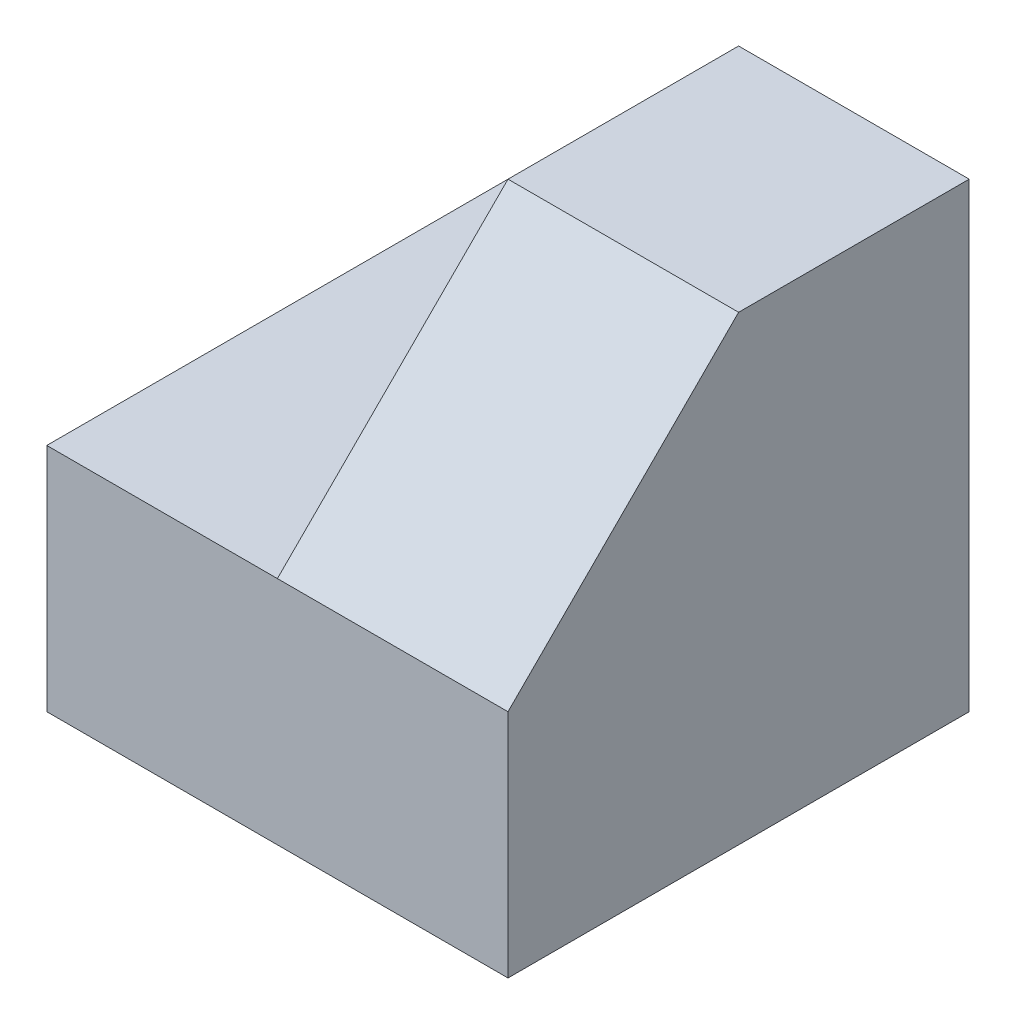
ISO-10303-21;
HEADER;
FILE_DESCRIPTION(('STEP AP214'),'2;1');
FILE_NAME('part.step','',(''),(''),'','','');
FILE_SCHEMA(('AUTOMOTIVE_DESIGN { 1 0 10303 214 1 1 1 1 }'));
ENDSEC;
DATA;
#1=APPLICATION_CONTEXT('core data for automotive mechanical design processes');
#2=APPLICATION_PROTOCOL_DEFINITION('international standard','automotive_design',2000,#1);
#3=PRODUCT_CONTEXT('',#1,'mechanical');
#4=PRODUCT('Part','Part','',(#3));
#5=PRODUCT_RELATED_PRODUCT_CATEGORY('part','',(#4));
#6=PRODUCT_DEFINITION_FORMATION('','',#4);
#7=PRODUCT_DEFINITION_CONTEXT('part definition',#1,'design');
#8=PRODUCT_DEFINITION('design','',#6,#7);
#9=PRODUCT_DEFINITION_SHAPE('','',#8);
#10=(LENGTH_UNIT() NAMED_UNIT(*) SI_UNIT(.MILLI.,.METRE.));
#11=(NAMED_UNIT(*) PLANE_ANGLE_UNIT() SI_UNIT($,.RADIAN.));
#12=(NAMED_UNIT(*) SI_UNIT($,.STERADIAN.) SOLID_ANGLE_UNIT());
#13=UNCERTAINTY_MEASURE_WITH_UNIT(LENGTH_MEASURE(1.E-05),#10,'distance_accuracy_value','');
#14=(GEOMETRIC_REPRESENTATION_CONTEXT(3) GLOBAL_UNCERTAINTY_ASSIGNED_CONTEXT((#13)) GLOBAL_UNIT_ASSIGNED_CONTEXT((#10,
#11,#12)) REPRESENTATION_CONTEXT('',''));
#15=CARTESIAN_POINT('',(0.,0.,0.));
#16=DIRECTION('',(0.,0.,1.));
#17=DIRECTION('',(1.,0.,0.));
#18=AXIS2_PLACEMENT_3D('',#15,#16,#17);
#19=CARTESIAN_POINT('',(0.,0.,40.));
#20=DIRECTION('',(1.,0.,0.));
#21=DIRECTION('',(0.,0.,-1.));
#22=AXIS2_PLACEMENT_3D('',#19,#20,#21);
#23=PLANE('',#22);
#24=DIRECTION('',(0.,-1.,0.));
#25=VECTOR('',#24,1.);
#26=CARTESIAN_POINT('',(0.,0.,40.));
#27=LINE('',#26,#25);
#28=CARTESIAN_POINT('',(0.,20.,40.));
#29=VERTEX_POINT('',#28);
#30=CARTESIAN_POINT('',(0.,0.,40.));
#31=VERTEX_POINT('',#30);
#32=EDGE_CURVE('E121',#29,#31,#27,.T.);
#33=ORIENTED_EDGE('',*,*,#32,.F.);
#34=DIRECTION('',(0.,0.,1.));
#35=VECTOR('',#34,1.);
#36=CARTESIAN_POINT('',(0.,20.,0.));
#37=LINE('',#36,#35);
#38=CARTESIAN_POINT('',(0.,20.,0.));
#39=VERTEX_POINT('',#38);
#40=EDGE_CURVE('E108',#39,#29,#37,.T.);
#41=ORIENTED_EDGE('',*,*,#40,.F.);
#42=DIRECTION('',(0.,-1.,0.));
#43=VECTOR('',#42,1.);
#44=CARTESIAN_POINT('',(0.,0.,0.));
#45=LINE('',#44,#43);
#46=CARTESIAN_POINT('',(0.,0.,0.));
#47=VERTEX_POINT('',#46);
#48=EDGE_CURVE('E118',#39,#47,#45,.T.);
#49=ORIENTED_EDGE('',*,*,#48,.T.);
#50=DIRECTION('',(0.,0.,-1.));
#51=VECTOR('',#50,1.);
#52=CARTESIAN_POINT('',(0.,0.,40.));
#53=LINE('',#52,#51);
#54=EDGE_CURVE('E11',#31,#47,#53,.T.);
#55=ORIENTED_EDGE('',*,*,#54,.F.);
#56=EDGE_LOOP('',(#33,#41,#49,#55));
#57=FACE_BOUND('',#56,.T.);
#58=ADVANCED_FACE('F32',(#57),#23,.F.);
#59=CARTESIAN_POINT('',(0.,0.,40.));
#60=DIRECTION('',(0.,1.,0.));
#61=DIRECTION('',(0.,0.,1.));
#62=AXIS2_PLACEMENT_3D('',#59,#60,#61);
#63=PLANE('',#62);
#64=DIRECTION('',(1.,0.,0.));
#65=VECTOR('',#64,1.);
#66=CARTESIAN_POINT('',(0.,0.,0.));
#67=LINE('',#66,#65);
#68=CARTESIAN_POINT('',(40.,0.,0.));
#69=VERTEX_POINT('',#68);
#70=EDGE_CURVE('E129',#47,#69,#67,.T.);
#71=ORIENTED_EDGE('',*,*,#70,.T.);
#72=DIRECTION('',(0.,0.,-1.));
#73=VECTOR('',#72,1.);
#74=CARTESIAN_POINT('',(40.,0.,40.));
#75=LINE('',#74,#73);
#76=CARTESIAN_POINT('',(40.,0.,40.));
#77=VERTEX_POINT('',#76);
#78=EDGE_CURVE('E39',#77,#69,#75,.T.);
#79=ORIENTED_EDGE('',*,*,#78,.F.);
#80=DIRECTION('',(1.,0.,0.));
#81=VECTOR('',#80,1.);
#82=CARTESIAN_POINT('',(0.,0.,40.));
#83=LINE('',#82,#81);
#84=EDGE_CURVE('E123',#31,#77,#83,.T.);
#85=ORIENTED_EDGE('',*,*,#84,.F.);
#86=ORIENTED_EDGE('',*,*,#54,.T.);
#87=EDGE_LOOP('',(#71,#79,#85,#86));
#88=FACE_BOUND('',#87,.T.);
#89=ADVANCED_FACE('F159',(#88),#63,.F.);
#90=CARTESIAN_POINT('',(40.,0.,40.));
#91=DIRECTION('',(-1.,0.,0.));
#92=DIRECTION('',(0.,0.,1.));
#93=AXIS2_PLACEMENT_3D('',#90,#91,#92);
#94=PLANE('',#93);
#95=DIRECTION('',(0.,0.,-1.));
#96=VECTOR('',#95,1.);
#97=CARTESIAN_POINT('',(40.,40.,40.));
#98=LINE('',#97,#96);
#99=CARTESIAN_POINT('',(40.,40.,20.));
#100=VERTEX_POINT('',#99);
#101=CARTESIAN_POINT('',(40.,40.,0.));
#102=VERTEX_POINT('',#101);
#103=EDGE_CURVE('E127',#100,#102,#98,.T.);
#104=ORIENTED_EDGE('',*,*,#103,.F.);
#105=DIRECTION('',(0.,-0.707106781186548,0.707106781186547));
#106=VECTOR('',#105,1.);
#107=CARTESIAN_POINT('',(40.,9.99999999999999,50.));
#108=LINE('',#107,#106);
#109=CARTESIAN_POINT('',(40.,20.,40.));
#110=VERTEX_POINT('',#109);
#111=EDGE_CURVE('E101',#100,#110,#108,.T.);
#112=ORIENTED_EDGE('',*,*,#111,.T.);
#113=DIRECTION('',(0.,1.,0.));
#114=VECTOR('',#113,1.);
#115=CARTESIAN_POINT('',(40.,0.,40.));
#116=LINE('',#115,#114);
#117=EDGE_CURVE('E100',#77,#110,#116,.T.);
#118=ORIENTED_EDGE('',*,*,#117,.F.);
#119=ORIENTED_EDGE('',*,*,#78,.T.);
#120=DIRECTION('',(0.,1.,0.));
#121=VECTOR('',#120,1.);
#122=CARTESIAN_POINT('',(40.,0.,0.));
#123=LINE('',#122,#121);
#124=EDGE_CURVE('E131',#69,#102,#123,.T.);
#125=ORIENTED_EDGE('',*,*,#124,.T.);
#126=EDGE_LOOP('',(#104,#112,#118,#119,#125));
#127=FACE_BOUND('',#126,.T.);
#128=ADVANCED_FACE('F141',(#127),#94,.F.);
#129=CARTESIAN_POINT('',(0.,40.,40.));
#130=DIRECTION('',(0.,-1.,0.));
#131=DIRECTION('',(0.,0.,-1.));
#132=AXIS2_PLACEMENT_3D('',#129,#130,#131);
#133=PLANE('',#132);
#134=DIRECTION('',(0.,0.,1.));
#135=VECTOR('',#134,1.);
#136=CARTESIAN_POINT('',(20.,40.,0.));
#137=LINE('',#136,#135);
#138=CARTESIAN_POINT('',(20.,40.,0.));
#139=VERTEX_POINT('',#138);
#140=CARTESIAN_POINT('',(20.,40.,20.));
#141=VERTEX_POINT('',#140);
#142=EDGE_CURVE('E107',#139,#141,#137,.T.);
#143=ORIENTED_EDGE('',*,*,#142,.T.);
#144=DIRECTION('',(-1.,0.,0.));
#145=VECTOR('',#144,1.);
#146=CARTESIAN_POINT('',(60.,40.,20.));
#147=LINE('',#146,#145);
#148=EDGE_CURVE('E46',#100,#141,#147,.T.);
#149=ORIENTED_EDGE('',*,*,#148,.F.);
#150=ORIENTED_EDGE('',*,*,#103,.T.);
#151=DIRECTION('',(-1.,0.,0.));
#152=VECTOR('',#151,1.);
#153=CARTESIAN_POINT('',(0.,40.,0.));
#154=LINE('',#153,#152);
#155=EDGE_CURVE('E124',#102,#139,#154,.T.);
#156=ORIENTED_EDGE('',*,*,#155,.T.);
#157=EDGE_LOOP('',(#143,#149,#150,#156));
#158=FACE_BOUND('',#157,.T.);
#159=ADVANCED_FACE('F150',(#158),#133,.F.);
#160=CARTESIAN_POINT('',(0.,0.,40.));
#161=DIRECTION('',(0.,0.,-1.));
#162=DIRECTION('',(-1.,0.,0.));
#163=AXIS2_PLACEMENT_3D('',#160,#161,#162);
#164=PLANE('',#163);
#165=ORIENTED_EDGE('',*,*,#117,.T.);
#166=DIRECTION('',(-1.,0.,0.));
#167=VECTOR('',#166,1.);
#168=CARTESIAN_POINT('',(60.,20.,40.));
#169=LINE('',#168,#167);
#170=CARTESIAN_POINT('',(20.,20.,40.));
#171=VERTEX_POINT('',#170);
#172=EDGE_CURVE('E88',#110,#171,#169,.T.);
#173=ORIENTED_EDGE('',*,*,#172,.T.);
#174=DIRECTION('',(1.,0.,0.));
#175=VECTOR('',#174,1.);
#176=CARTESIAN_POINT('',(0.,20.,40.));
#177=LINE('',#176,#175);
#178=EDGE_CURVE('E97',#29,#171,#177,.T.);
#179=ORIENTED_EDGE('',*,*,#178,.F.);
#180=ORIENTED_EDGE('',*,*,#32,.T.);
#181=ORIENTED_EDGE('',*,*,#84,.T.);
#182=EDGE_LOOP('',(#165,#173,#179,#180,#181));
#183=FACE_BOUND('',#182,.T.);
#184=ADVANCED_FACE('F95',(#183),#164,.F.);
#185=CARTESIAN_POINT('',(0.,0.,0.));
#186=DIRECTION('',(0.,0.,-1.));
#187=DIRECTION('',(-1.,0.,0.));
#188=AXIS2_PLACEMENT_3D('',#185,#186,#187);
#189=PLANE('',#188);
#190=DIRECTION('',(0.,1.,0.));
#191=VECTOR('',#190,1.);
#192=CARTESIAN_POINT('',(20.,40.,0.));
#193=LINE('',#192,#191);
#194=CARTESIAN_POINT('',(20.,20.,0.));
#195=VERTEX_POINT('',#194);
#196=EDGE_CURVE('E54',#195,#139,#193,.T.);
#197=ORIENTED_EDGE('',*,*,#196,.T.);
#198=ORIENTED_EDGE('',*,*,#155,.F.);
#199=ORIENTED_EDGE('',*,*,#124,.F.);
#200=ORIENTED_EDGE('',*,*,#70,.F.);
#201=ORIENTED_EDGE('',*,*,#48,.F.);
#202=DIRECTION('',(1.,0.,0.));
#203=VECTOR('',#202,1.);
#204=CARTESIAN_POINT('',(0.,20.,0.));
#205=LINE('',#204,#203);
#206=EDGE_CURVE('E112',#39,#195,#205,.T.);
#207=ORIENTED_EDGE('',*,*,#206,.T.);
#208=EDGE_LOOP('',(#197,#198,#199,#200,#201,#207));
#209=FACE_BOUND('',#208,.T.);
#210=ADVANCED_FACE('F147',(#209),#189,.T.);
#211=CARTESIAN_POINT('',(20.,40.,0.));
#212=DIRECTION('',(1.,0.,0.));
#213=DIRECTION('',(0.,1.,0.));
#214=AXIS2_PLACEMENT_3D('',#211,#212,#213);
#215=PLANE('',#214);
#216=DIRECTION('',(0.,0.,1.));
#217=VECTOR('',#216,1.);
#218=CARTESIAN_POINT('',(20.,20.,0.));
#219=LINE('',#218,#217);
#220=EDGE_CURVE('E103',#195,#171,#219,.T.);
#221=ORIENTED_EDGE('',*,*,#220,.T.);
#222=DIRECTION('',(0.,-0.707106781186548,0.707106781186547));
#223=VECTOR('',#222,1.);
#224=CARTESIAN_POINT('',(20.,40.,20.));
#225=LINE('',#224,#223);
#226=EDGE_CURVE('E85',#141,#171,#225,.T.);
#227=ORIENTED_EDGE('',*,*,#226,.F.);
#228=ORIENTED_EDGE('',*,*,#142,.F.);
#229=ORIENTED_EDGE('',*,*,#196,.F.);
#230=EDGE_LOOP('',(#221,#227,#228,#229));
#231=FACE_BOUND('',#230,.T.);
#232=ADVANCED_FACE('F104',(#231),#215,.F.);
#233=CARTESIAN_POINT('',(0.,20.,0.));
#234=DIRECTION('',(0.,-1.,0.));
#235=DIRECTION('',(0.,0.,-1.));
#236=AXIS2_PLACEMENT_3D('',#233,#234,#235);
#237=PLANE('',#236);
#238=ORIENTED_EDGE('',*,*,#178,.T.);
#239=ORIENTED_EDGE('',*,*,#220,.F.);
#240=ORIENTED_EDGE('',*,*,#206,.F.);
#241=ORIENTED_EDGE('',*,*,#40,.T.);
#242=EDGE_LOOP('',(#238,#239,#240,#241));
#243=FACE_BOUND('',#242,.T.);
#244=ADVANCED_FACE('F110',(#243),#237,.F.);
#245=CARTESIAN_POINT('',(60.,40.,20.));
#246=DIRECTION('',(0.,-0.707106781186547,-0.707106781186548));
#247=DIRECTION('',(0.,0.707106781186548,-0.707106781186547));
#248=AXIS2_PLACEMENT_3D('',#245,#246,#247);
#249=PLANE('',#248);
#250=ORIENTED_EDGE('',*,*,#148,.T.);
#251=ORIENTED_EDGE('',*,*,#226,.T.);
#252=ORIENTED_EDGE('',*,*,#172,.F.);
#253=ORIENTED_EDGE('',*,*,#111,.F.);
#254=EDGE_LOOP('',(#250,#251,#252,#253));
#255=FACE_BOUND('',#254,.T.);
#256=ADVANCED_FACE('F87',(#255),#249,.F.);
#257=CLOSED_SHELL('',(#58,#89,#128,#159,#184,#210,#232,#244,#256));
#258=MANIFOLD_SOLID_BREP('B2',#257);
#259=ADVANCED_BREP_SHAPE_REPRESENTATION('',(#18,#258),#14);
#260=SHAPE_DEFINITION_REPRESENTATION(#9,#259);
ENDSEC;
END-ISO-10303-21;
